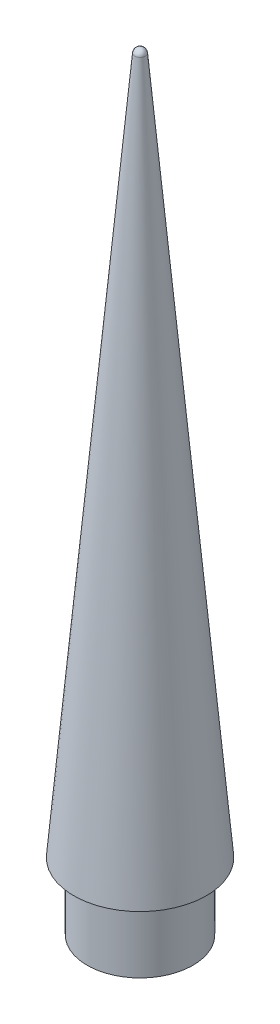
ISO-10303-21;
HEADER;
FILE_DESCRIPTION(('STEP AP214'),'2;1');
FILE_NAME('part.step','',(''),(''),'','','');
FILE_SCHEMA(('AUTOMOTIVE_DESIGN { 1 0 10303 214 1 1 1 1 }'));
ENDSEC;
DATA;
#1=APPLICATION_CONTEXT('core data for automotive mechanical design processes');
#2=APPLICATION_PROTOCOL_DEFINITION('international standard','automotive_design',2000,#1);
#3=PRODUCT_CONTEXT('',#1,'mechanical');
#4=PRODUCT('Part','Part','',(#3));
#5=PRODUCT_RELATED_PRODUCT_CATEGORY('part','',(#4));
#6=PRODUCT_DEFINITION_FORMATION('','',#4);
#7=PRODUCT_DEFINITION_CONTEXT('part definition',#1,'design');
#8=PRODUCT_DEFINITION('design','',#6,#7);
#9=PRODUCT_DEFINITION_SHAPE('','',#8);
#10=(LENGTH_UNIT() NAMED_UNIT(*) SI_UNIT(.MILLI.,.METRE.));
#11=(NAMED_UNIT(*) PLANE_ANGLE_UNIT() SI_UNIT($,.RADIAN.));
#12=(NAMED_UNIT(*) SI_UNIT($,.STERADIAN.) SOLID_ANGLE_UNIT());
#13=UNCERTAINTY_MEASURE_WITH_UNIT(LENGTH_MEASURE(1.E-05),#10,'distance_accuracy_value','');
#14=(GEOMETRIC_REPRESENTATION_CONTEXT(3) GLOBAL_UNCERTAINTY_ASSIGNED_CONTEXT((#13)) GLOBAL_UNIT_ASSIGNED_CONTEXT((#10,
#11,#12)) REPRESENTATION_CONTEXT('',''));
#15=CARTESIAN_POINT('',(0.,0.,0.));
#16=DIRECTION('',(0.,0.,1.));
#17=DIRECTION('',(1.,0.,0.));
#18=AXIS2_PLACEMENT_3D('',#15,#16,#17);
#19=CARTESIAN_POINT('',(12.573,0.,0.));
#20=DIRECTION('',(0.,-1.,0.));
#21=DIRECTION('',(0.,0.,-1.));
#22=AXIS2_PLACEMENT_3D('',#19,#20,#21);
#23=PLANE('',#22);
#24=CARTESIAN_POINT('',(0.,0.,0.));
#25=DIRECTION('',(0.,-1.,0.));
#26=DIRECTION('',(0.,0.,-1.));
#27=AXIS2_PLACEMENT_3D('',#24,#25,#26);
#28=CIRCLE('',#27,10.033);
#29=CARTESIAN_POINT('',(0.,0.,-10.033));
#30=VERTEX_POINT('',#29);
#31=EDGE_CURVE('E11',#30,#30,#28,.T.);
#32=ORIENTED_EDGE('',*,*,#31,.F.);
#33=EDGE_LOOP('',(#32));
#34=FACE_BOUND('',#33,.T.);
#35=CARTESIAN_POINT('',(0.,0.,0.));
#36=DIRECTION('',(0.,-1.,0.));
#37=DIRECTION('',(0.,0.,-1.));
#38=AXIS2_PLACEMENT_3D('',#35,#36,#37);
#39=CIRCLE('',#38,12.573);
#40=CARTESIAN_POINT('',(0.,0.,-12.573));
#41=VERTEX_POINT('',#40);
#42=EDGE_CURVE('E63',#41,#41,#39,.T.);
#43=ORIENTED_EDGE('',*,*,#42,.T.);
#44=EDGE_LOOP('',(#43));
#45=FACE_BOUND('',#44,.T.);
#46=ADVANCED_FACE('F60',(#34,#45),#23,.T.);
#47=CARTESIAN_POINT('',(0.,0.,0.));
#48=DIRECTION('',(0.,-1.,0.));
#49=DIRECTION('',(0.,0.,-1.));
#50=AXIS2_PLACEMENT_3D('',#47,#48,#49);
#51=CONICAL_SURFACE('',#50,12.573,0.0872664625997099);
#52=CARTESIAN_POINT('',(0.,132.141305179659,0.));
#53=DIRECTION('',(0.,-1.,0.));
#54=DIRECTION('',(0.,0.,-1.));
#55=AXIS2_PLACEMENT_3D('',#52,#53,#54);
#56=CIRCLE('',#55,1.01213381326121);
#57=CARTESIAN_POINT('',(0.,132.141305179659,-1.01213381326121));
#58=VERTEX_POINT('',#57);
#59=EDGE_CURVE('E91',#58,#58,#56,.T.);
#60=ORIENTED_EDGE('',*,*,#59,.T.);
#61=EDGE_LOOP('',(#60));
#62=FACE_BOUND('',#61,.T.);
#63=ORIENTED_EDGE('',*,*,#42,.F.);
#64=EDGE_LOOP('',(#63));
#65=FACE_BOUND('',#64,.T.);
#66=ADVANCED_FACE('F105',(#62,#65),#51,.T.);
#67=CARTESIAN_POINT('',(0.,132.052754945028,0.));
#68=DIRECTION('',(0.,-1.,0.));
#69=DIRECTION('',(1.,0.,0.));
#70=AXIS2_PLACEMENT_3D('',#67,#68,#69);
#71=SPHERICAL_SURFACE('',#70,1.01599999999999);
#72=ORIENTED_EDGE('',*,*,#59,.F.);
#73=EDGE_LOOP('',(#72));
#74=FACE_BOUND('',#73,.T.);
#75=ADVANCED_FACE('F107',(#74),#71,.T.);
#76=CARTESIAN_POINT('',(0.,-12.7,0.));
#77=DIRECTION('',(0.,1.,0.));
#78=DIRECTION('',(0.,0.,1.));
#79=AXIS2_PLACEMENT_3D('',#76,#77,#78);
#80=CYLINDRICAL_SURFACE('',#79,10.033);
#81=CARTESIAN_POINT('',(0.,-12.7,0.));
#82=DIRECTION('',(0.,-1.,0.));
#83=DIRECTION('',(0.,0.,-1.));
#84=AXIS2_PLACEMENT_3D('',#81,#82,#83);
#85=CIRCLE('',#84,10.033);
#86=CARTESIAN_POINT('',(0.,-12.7,-10.033));
#87=VERTEX_POINT('',#86);
#88=EDGE_CURVE('E83',#87,#87,#85,.T.);
#89=ORIENTED_EDGE('',*,*,#88,.F.);
#90=EDGE_LOOP('',(#89));
#91=FACE_BOUND('',#90,.T.);
#92=ORIENTED_EDGE('',*,*,#31,.T.);
#93=EDGE_LOOP('',(#92));
#94=FACE_BOUND('',#93,.T.);
#95=ADVANCED_FACE('F111',(#91,#94),#80,.T.);
#96=CARTESIAN_POINT('',(0.,-12.7,0.));
#97=DIRECTION('',(0.,-1.,0.));
#98=DIRECTION('',(0.,0.,-1.));
#99=AXIS2_PLACEMENT_3D('',#96,#97,#98);
#100=PLANE('',#99);
#101=CARTESIAN_POINT('',(0.,-12.7,0.));
#102=DIRECTION('',(0.,-1.,0.));
#103=DIRECTION('',(0.,0.,-1.));
#104=AXIS2_PLACEMENT_3D('',#101,#102,#103);
#105=CIRCLE('',#104,1.25);
#106=CARTESIAN_POINT('',(0.,-12.7,-1.25));
#107=VERTEX_POINT('',#106);
#108=EDGE_CURVE('E84',#107,#107,#105,.T.);
#109=ORIENTED_EDGE('',*,*,#108,.F.);
#110=EDGE_LOOP('',(#109));
#111=FACE_BOUND('',#110,.T.);
#112=ORIENTED_EDGE('',*,*,#88,.T.);
#113=EDGE_LOOP('',(#112));
#114=FACE_BOUND('',#113,.T.);
#115=ADVANCED_FACE('F76',(#111,#114),#100,.T.);
#116=CARTESIAN_POINT('',(0.,-2.54,0.));
#117=DIRECTION('',(0.,-1.,0.));
#118=DIRECTION('',(0.,0.,-1.));
#119=AXIS2_PLACEMENT_3D('',#116,#117,#118);
#120=CONICAL_SURFACE('',#119,1.25,1.02974425867665);
#121=CARTESIAN_POINT('',(0.,-1.78892422621555,0.));
#122=VERTEX_POINT('',#121);
#123=VERTEX_LOOP('',#122);
#124=FACE_BOUND('',#123,.T.);
#125=CARTESIAN_POINT('',(0.,-2.54,0.));
#126=DIRECTION('',(0.,-1.,0.));
#127=DIRECTION('',(0.,0.,-1.));
#128=AXIS2_PLACEMENT_3D('',#125,#126,#127);
#129=CIRCLE('',#128,1.25);
#130=CARTESIAN_POINT('',(0.,-2.54,-1.25));
#131=VERTEX_POINT('',#130);
#132=EDGE_CURVE('E80',#131,#131,#129,.T.);
#133=ORIENTED_EDGE('',*,*,#132,.T.);
#134=EDGE_LOOP('',(#133));
#135=FACE_BOUND('',#134,.T.);
#136=ADVANCED_FACE('F72',(#124,#135),#120,.F.);
#137=CARTESIAN_POINT('',(0.,-12.7,0.));
#138=DIRECTION('',(0.,-1.,0.));
#139=DIRECTION('',(0.,0.,-1.));
#140=AXIS2_PLACEMENT_3D('',#137,#138,#139);
#141=CYLINDRICAL_SURFACE('',#140,1.25);
#142=ORIENTED_EDGE('',*,*,#132,.F.);
#143=EDGE_LOOP('',(#142));
#144=FACE_BOUND('',#143,.T.);
#145=ORIENTED_EDGE('',*,*,#108,.T.);
#146=EDGE_LOOP('',(#145));
#147=FACE_BOUND('',#146,.T.);
#148=ADVANCED_FACE('F75',(#144,#147),#141,.F.);
#149=CLOSED_SHELL('',(#46,#66,#75,#95,#115,#136,#148));
#150=MANIFOLD_SOLID_BREP('B2',#149);
#151=ADVANCED_BREP_SHAPE_REPRESENTATION('',(#18,#150),#14);
#152=SHAPE_DEFINITION_REPRESENTATION(#9,#151);
ENDSEC;
END-ISO-10303-21;
